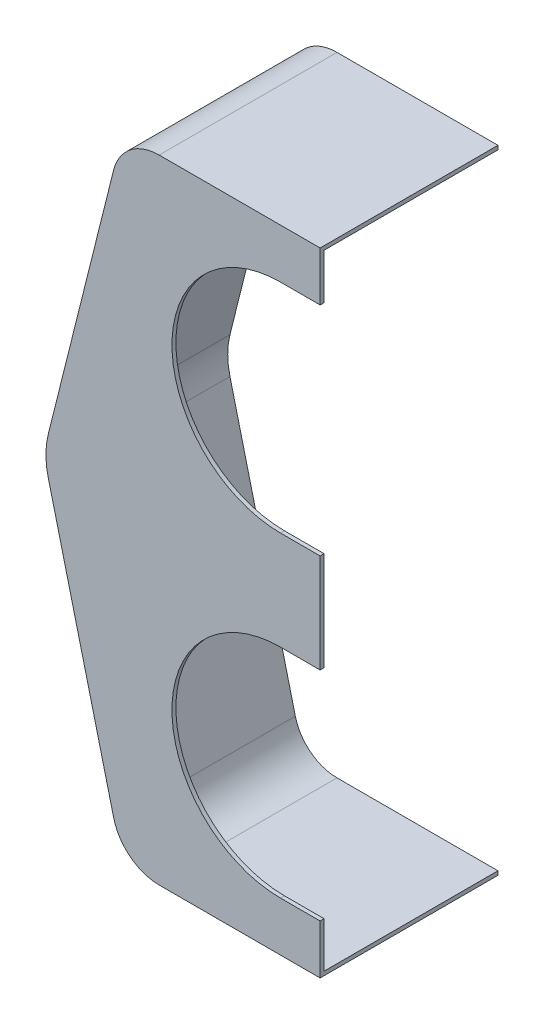
ISO-10303-21;
HEADER;
FILE_DESCRIPTION(('STEP AP214'),'2;1');
FILE_NAME('part.step','',(''),(''),'','','');
FILE_SCHEMA(('AUTOMOTIVE_DESIGN { 1 0 10303 214 1 1 1 1 }'));
ENDSEC;
DATA;
#1=APPLICATION_CONTEXT('core data for automotive mechanical design processes');
#2=APPLICATION_PROTOCOL_DEFINITION('international standard','automotive_design',2000,#1);
#3=PRODUCT_CONTEXT('',#1,'mechanical');
#4=PRODUCT('Part','Part','',(#3));
#5=PRODUCT_RELATED_PRODUCT_CATEGORY('part','',(#4));
#6=PRODUCT_DEFINITION_FORMATION('','',#4);
#7=PRODUCT_DEFINITION_CONTEXT('part definition',#1,'design');
#8=PRODUCT_DEFINITION('design','',#6,#7);
#9=PRODUCT_DEFINITION_SHAPE('','',#8);
#10=(LENGTH_UNIT() NAMED_UNIT(*) SI_UNIT(.MILLI.,.METRE.));
#11=(NAMED_UNIT(*) PLANE_ANGLE_UNIT() SI_UNIT($,.RADIAN.));
#12=(NAMED_UNIT(*) SI_UNIT($,.STERADIAN.) SOLID_ANGLE_UNIT());
#13=UNCERTAINTY_MEASURE_WITH_UNIT(LENGTH_MEASURE(1.E-05),#10,'distance_accuracy_value','');
#14=(GEOMETRIC_REPRESENTATION_CONTEXT(3) GLOBAL_UNCERTAINTY_ASSIGNED_CONTEXT((#13)) GLOBAL_UNIT_ASSIGNED_CONTEXT((#10,
#11,#12)) REPRESENTATION_CONTEXT('',''));
#15=CARTESIAN_POINT('',(0.,0.,0.));
#16=DIRECTION('',(0.,0.,1.));
#17=DIRECTION('',(1.,0.,0.));
#18=AXIS2_PLACEMENT_3D('',#15,#16,#17);
#19=CARTESIAN_POINT('',(0.,0.,0.));
#20=DIRECTION('',(1.,0.,0.));
#21=DIRECTION('',(0.,0.,-1.));
#22=AXIS2_PLACEMENT_3D('',#19,#20,#21);
#23=PLANE('',#22);
#24=DIRECTION('',(0.,-1.,0.));
#25=VECTOR('',#24,1.);
#26=CARTESIAN_POINT('',(0.,0.,-1.27));
#27=LINE('',#26,#25);
#28=CARTESIAN_POINT('',(0.,-85.725,-1.27000000000001));
#29=VERTEX_POINT('',#28);
#30=CARTESIAN_POINT('',(0.,-117.475,-1.27000000000001));
#31=VERTEX_POINT('',#30);
#32=EDGE_CURVE('E339',#29,#31,#27,.T.);
#33=ORIENTED_EDGE('',*,*,#32,.F.);
#34=DIRECTION('',(0.,0.,1.));
#35=VECTOR('',#34,1.);
#36=CARTESIAN_POINT('',(0.,-85.725,-114.3));
#37=LINE('',#36,#35);
#38=CARTESIAN_POINT('',(0.,-85.725,0.));
#39=VERTEX_POINT('',#38);
#40=EDGE_CURVE('E365',#29,#39,#37,.T.);
#41=ORIENTED_EDGE('',*,*,#40,.T.);
#42=DIRECTION('',(0.,-1.,0.));
#43=VECTOR('',#42,1.);
#44=CARTESIAN_POINT('',(0.,0.,0.));
#45=LINE('',#44,#43);
#46=CARTESIAN_POINT('',(0.,-117.475,0.));
#47=VERTEX_POINT('',#46);
#48=EDGE_CURVE('E229',#39,#47,#45,.T.);
#49=ORIENTED_EDGE('',*,*,#48,.T.);
#50=DIRECTION('',(0.,0.,1.));
#51=VECTOR('',#50,1.);
#52=CARTESIAN_POINT('',(0.,-117.475,-114.3));
#53=LINE('',#52,#51);
#54=EDGE_CURVE('E377',#31,#47,#53,.T.);
#55=ORIENTED_EDGE('',*,*,#54,.F.);
#56=EDGE_LOOP('',(#33,#41,#49,#55));
#57=FACE_BOUND('',#56,.T.);
#58=ADVANCED_FACE('F38',(#57),#23,.T.);
#59=CARTESIAN_POINT('',(-12.7,-152.4,-114.3));
#60=DIRECTION('',(0.,0.,1.));
#61=DIRECTION('',(1.,0.,0.));
#62=AXIS2_PLACEMENT_3D('',#59,#60,#61);
#63=CYLINDRICAL_SURFACE('',#62,34.925);
#64=CARTESIAN_POINT('',(-12.7,-152.4,-1.27000000000002));
#65=DIRECTION('',(0.,0.,1.));
#66=DIRECTION('',(0.,-1.,0.));
#67=AXIS2_PLACEMENT_3D('',#64,#65,#66);
#68=CIRCLE('',#67,34.925);
#69=CARTESIAN_POINT('',(-12.7,-117.475,-1.27000000000001));
#70=VERTEX_POINT('',#69);
#71=CARTESIAN_POINT('',(-12.7,-187.325,-1.27000000000002));
#72=VERTEX_POINT('',#71);
#73=EDGE_CURVE('E335',#70,#72,#68,.T.);
#74=ORIENTED_EDGE('',*,*,#73,.F.);
#75=DIRECTION('',(0.,0.,1.));
#76=VECTOR('',#75,1.);
#77=CARTESIAN_POINT('',(-12.7,-117.475,-114.3));
#78=LINE('',#77,#76);
#79=CARTESIAN_POINT('',(-12.7,-117.475,0.));
#80=VERTEX_POINT('',#79);
#81=EDGE_CURVE('E271',#70,#80,#78,.T.);
#82=ORIENTED_EDGE('',*,*,#81,.T.);
#83=CARTESIAN_POINT('',(-12.7,-152.4,0.));
#84=DIRECTION('',(0.,0.,1.));
#85=DIRECTION('',(1.,0.,0.));
#86=AXIS2_PLACEMENT_3D('',#83,#84,#85);
#87=CIRCLE('',#86,34.925);
#88=CARTESIAN_POINT('',(-12.7,-187.325,0.));
#89=VERTEX_POINT('',#88);
#90=EDGE_CURVE('E362',#80,#89,#87,.T.);
#91=ORIENTED_EDGE('',*,*,#90,.T.);
#92=DIRECTION('',(0.,0.,1.));
#93=VECTOR('',#92,1.);
#94=CARTESIAN_POINT('',(-12.7,-187.325,-114.3));
#95=LINE('',#94,#93);
#96=EDGE_CURVE('E375',#72,#89,#95,.T.);
#97=ORIENTED_EDGE('',*,*,#96,.F.);
#98=EDGE_LOOP('',(#74,#82,#91,#97));
#99=FACE_BOUND('',#98,.T.);
#100=ADVANCED_FACE('F401',(#99),#63,.F.);
#101=CARTESIAN_POINT('',(-12.7,-117.475,-114.3));
#102=DIRECTION('',(0.,1.,0.));
#103=DIRECTION('',(0.,0.,1.));
#104=AXIS2_PLACEMENT_3D('',#101,#102,#103);
#105=PLANE('',#104);
#106=DIRECTION('',(-1.,0.,0.));
#107=VECTOR('',#106,1.);
#108=CARTESIAN_POINT('',(-88.9,-117.475,-1.27000000000002));
#109=LINE('',#108,#107);
#110=EDGE_CURVE('E316',#31,#70,#109,.T.);
#111=ORIENTED_EDGE('',*,*,#110,.F.);
#112=ORIENTED_EDGE('',*,*,#54,.T.);
#113=DIRECTION('',(-1.,0.,0.));
#114=VECTOR('',#113,1.);
#115=CARTESIAN_POINT('',(-12.7,-117.475,0.));
#116=LINE('',#115,#114);
#117=EDGE_CURVE('E372',#47,#80,#116,.T.);
#118=ORIENTED_EDGE('',*,*,#117,.T.);
#119=ORIENTED_EDGE('',*,*,#81,.F.);
#120=EDGE_LOOP('',(#111,#112,#118,#119));
#121=FACE_BOUND('',#120,.T.);
#122=ADVANCED_FACE('F394',(#121),#105,.F.);
#123=CARTESIAN_POINT('',(-12.7,-187.325,-114.3));
#124=DIRECTION('',(0.,-1.,0.));
#125=DIRECTION('',(0.,0.,-1.));
#126=AXIS2_PLACEMENT_3D('',#123,#124,#125);
#127=PLANE('',#126);
#128=DIRECTION('',(1.,0.,0.));
#129=VECTOR('',#128,1.);
#130=CARTESIAN_POINT('',(-88.9,-187.325,-1.27000000000003));
#131=LINE('',#130,#129);
#132=CARTESIAN_POINT('',(0.,-187.325,-1.27000000000002));
#133=VERTEX_POINT('',#132);
#134=EDGE_CURVE('E343',#72,#133,#131,.T.);
#135=ORIENTED_EDGE('',*,*,#134,.F.);
#136=ORIENTED_EDGE('',*,*,#96,.T.);
#137=DIRECTION('',(1.,0.,0.));
#138=VECTOR('',#137,1.);
#139=CARTESIAN_POINT('',(-12.7,-187.325,0.));
#140=LINE('',#139,#138);
#141=CARTESIAN_POINT('',(0.,-187.325,0.));
#142=VERTEX_POINT('',#141);
#143=EDGE_CURVE('E370',#89,#142,#140,.T.);
#144=ORIENTED_EDGE('',*,*,#143,.T.);
#145=DIRECTION('',(0.,0.,1.));
#146=VECTOR('',#145,1.);
#147=CARTESIAN_POINT('',(0.,-187.325,-114.3));
#148=LINE('',#147,#146);
#149=EDGE_CURVE('E60',#133,#142,#148,.T.);
#150=ORIENTED_EDGE('',*,*,#149,.F.);
#151=EDGE_LOOP('',(#135,#136,#144,#150));
#152=FACE_BOUND('',#151,.T.);
#153=ADVANCED_FACE('F403',(#152),#127,.F.);
#154=CARTESIAN_POINT('',(-12.7,-50.8,-114.3));
#155=DIRECTION('',(0.,0.,1.));
#156=DIRECTION('',(1.,0.,0.));
#157=AXIS2_PLACEMENT_3D('',#154,#155,#156);
#158=CYLINDRICAL_SURFACE('',#157,34.925);
#159=CARTESIAN_POINT('',(-12.7,-50.8,-1.27000000000001));
#160=DIRECTION('',(0.,0.,1.));
#161=DIRECTION('',(0.,-1.,0.));
#162=AXIS2_PLACEMENT_3D('',#159,#160,#161);
#163=CIRCLE('',#162,34.925);
#164=CARTESIAN_POINT('',(-12.7,-15.875,-1.26999999999999));
#165=VERTEX_POINT('',#164);
#166=CARTESIAN_POINT('',(-12.7,-85.725,-1.27000000000001));
#167=VERTEX_POINT('',#166);
#168=EDGE_CURVE('E293',#165,#167,#163,.T.);
#169=ORIENTED_EDGE('',*,*,#168,.F.);
#170=DIRECTION('',(0.,0.,1.));
#171=VECTOR('',#170,1.);
#172=CARTESIAN_POINT('',(-12.7,-15.875,-114.3));
#173=LINE('',#172,#171);
#174=CARTESIAN_POINT('',(-12.7,-15.875,0.));
#175=VERTEX_POINT('',#174);
#176=EDGE_CURVE('E360',#165,#175,#173,.T.);
#177=ORIENTED_EDGE('',*,*,#176,.T.);
#178=CARTESIAN_POINT('',(-12.7,-50.8,0.));
#179=DIRECTION('',(0.,0.,1.));
#180=DIRECTION('',(1.,0.,0.));
#181=AXIS2_PLACEMENT_3D('',#178,#179,#180);
#182=CIRCLE('',#181,34.925);
#183=CARTESIAN_POINT('',(-12.7,-85.725,0.));
#184=VERTEX_POINT('',#183);
#185=EDGE_CURVE('E327',#175,#184,#182,.T.);
#186=ORIENTED_EDGE('',*,*,#185,.T.);
#187=DIRECTION('',(0.,0.,1.));
#188=VECTOR('',#187,1.);
#189=CARTESIAN_POINT('',(-12.7,-85.725,-114.3));
#190=LINE('',#189,#188);
#191=EDGE_CURVE('E359',#167,#184,#190,.T.);
#192=ORIENTED_EDGE('',*,*,#191,.F.);
#193=EDGE_LOOP('',(#169,#177,#186,#192));
#194=FACE_BOUND('',#193,.T.);
#195=ADVANCED_FACE('F452',(#194),#158,.F.);
#196=CARTESIAN_POINT('',(-12.7,-15.875,-114.3));
#197=DIRECTION('',(0.,1.,0.));
#198=DIRECTION('',(0.,0.,1.));
#199=AXIS2_PLACEMENT_3D('',#196,#197,#198);
#200=PLANE('',#199);
#201=DIRECTION('',(-1.,0.,0.));
#202=VECTOR('',#201,1.);
#203=CARTESIAN_POINT('',(-88.9,-15.875,-1.27));
#204=LINE('',#203,#202);
#205=CARTESIAN_POINT('',(0.,-15.875,-1.26999999999999));
#206=VERTEX_POINT('',#205);
#207=EDGE_CURVE('E333',#206,#165,#204,.T.);
#208=ORIENTED_EDGE('',*,*,#207,.F.);
#209=DIRECTION('',(0.,0.,1.));
#210=VECTOR('',#209,1.);
#211=CARTESIAN_POINT('',(0.,-15.875,-114.3));
#212=LINE('',#211,#210);
#213=CARTESIAN_POINT('',(0.,-15.875,0.));
#214=VERTEX_POINT('',#213);
#215=EDGE_CURVE('E363',#206,#214,#212,.T.);
#216=ORIENTED_EDGE('',*,*,#215,.T.);
#217=DIRECTION('',(-1.,0.,0.));
#218=VECTOR('',#217,1.);
#219=CARTESIAN_POINT('',(-12.7,-15.875,0.));
#220=LINE('',#219,#218);
#221=EDGE_CURVE('E356',#214,#175,#220,.T.);
#222=ORIENTED_EDGE('',*,*,#221,.T.);
#223=ORIENTED_EDGE('',*,*,#176,.F.);
#224=EDGE_LOOP('',(#208,#216,#222,#223));
#225=FACE_BOUND('',#224,.T.);
#226=ADVANCED_FACE('F445',(#225),#200,.F.);
#227=CARTESIAN_POINT('',(-12.7,-85.725,-114.3));
#228=DIRECTION('',(0.,-1.,0.));
#229=DIRECTION('',(0.,0.,-1.));
#230=AXIS2_PLACEMENT_3D('',#227,#228,#229);
#231=PLANE('',#230);
#232=DIRECTION('',(1.,0.,0.));
#233=VECTOR('',#232,1.);
#234=CARTESIAN_POINT('',(-88.9,-85.725,-1.27000000000001));
#235=LINE('',#234,#233);
#236=EDGE_CURVE('E336',#167,#29,#235,.T.);
#237=ORIENTED_EDGE('',*,*,#236,.F.);
#238=ORIENTED_EDGE('',*,*,#191,.T.);
#239=DIRECTION('',(1.,0.,0.));
#240=VECTOR('',#239,1.);
#241=CARTESIAN_POINT('',(-12.7,-85.725,0.));
#242=LINE('',#241,#240);
#243=EDGE_CURVE('E353',#184,#39,#242,.T.);
#244=ORIENTED_EDGE('',*,*,#243,.T.);
#245=ORIENTED_EDGE('',*,*,#40,.F.);
#246=EDGE_LOOP('',(#237,#238,#244,#245));
#247=FACE_BOUND('',#246,.T.);
#248=ADVANCED_FACE('F455',(#247),#231,.F.);
#249=DIRECTION('',(0.,1.,0.));
#250=VECTOR('',#249,1.);
#251=CARTESIAN_POINT('',(0.,-203.2,-57.15));
#252=LINE('',#251,#250);
#253=CARTESIAN_POINT('',(0.,-1.26999999999999,-57.15));
#254=VERTEX_POINT('',#253);
#255=CARTESIAN_POINT('',(0.,0.,-57.15));
#256=VERTEX_POINT('',#255);
#257=EDGE_CURVE('E207',#254,#256,#252,.T.);
#258=ORIENTED_EDGE('',*,*,#257,.T.);
#259=DIRECTION('',(0.,0.,1.));
#260=VECTOR('',#259,1.);
#261=CARTESIAN_POINT('',(0.,0.,0.));
#262=LINE('',#261,#260);
#263=CARTESIAN_POINT('',(0.,0.,0.));
#264=VERTEX_POINT('',#263);
#265=EDGE_CURVE('E223',#256,#264,#262,.T.);
#266=ORIENTED_EDGE('',*,*,#265,.T.);
#267=EDGE_CURVE('E224',#264,#214,#45,.T.);
#268=ORIENTED_EDGE('',*,*,#267,.T.);
#269=ORIENTED_EDGE('',*,*,#215,.F.);
#270=DIRECTION('',(0.,-1.,0.));
#271=VECTOR('',#270,1.);
#272=CARTESIAN_POINT('',(0.,0.,-1.27));
#273=LINE('',#272,#271);
#274=CARTESIAN_POINT('',(0.,-1.27,-1.27));
#275=VERTEX_POINT('',#274);
#276=EDGE_CURVE('E341',#275,#206,#273,.T.);
#277=ORIENTED_EDGE('',*,*,#276,.F.);
#278=DIRECTION('',(0.,0.,1.));
#279=VECTOR('',#278,1.);
#280=CARTESIAN_POINT('',(0.,-1.27,0.));
#281=LINE('',#280,#279);
#282=EDGE_CURVE('E321',#254,#275,#281,.T.);
#283=ORIENTED_EDGE('',*,*,#282,.F.);
#284=EDGE_LOOP('',(#258,#266,#268,#269,#277,#283));
#285=FACE_BOUND('',#284,.T.);
#286=ADVANCED_FACE('F442',(#285),#23,.T.);
#287=CARTESIAN_POINT('',(-88.9,0.,0.));
#288=DIRECTION('',(0.,0.,1.));
#289=DIRECTION('',(0.,-1.,0.));
#290=AXIS2_PLACEMENT_3D('',#287,#288,#289);
#291=PLANE('',#290);
#292=ORIENTED_EDGE('',*,*,#221,.F.);
#293=ORIENTED_EDGE('',*,*,#267,.F.);
#294=DIRECTION('',(1.,0.,0.));
#295=VECTOR('',#294,1.);
#296=CARTESIAN_POINT('',(-88.9,0.,0.));
#297=LINE('',#296,#295);
#298=CARTESIAN_POINT('',(-51.7258917914214,0.,0.));
#299=VERTEX_POINT('',#298);
#300=EDGE_CURVE('E233',#299,#264,#297,.T.);
#301=ORIENTED_EDGE('',*,*,#300,.F.);
#302=CARTESIAN_POINT('',(-51.7258917914214,-15.08,0.));
#303=DIRECTION('',(0.,0.,1.));
#304=DIRECTION('',(0.,-1.,0.));
#305=AXIS2_PLACEMENT_3D('',#302,#303,#304);
#306=CIRCLE('',#305,15.08);
#307=CARTESIAN_POINT('',(-66.355640693613,-11.4225627744521,0.));
#308=VERTEX_POINT('',#307);
#309=EDGE_CURVE('E251',#299,#308,#306,.T.);
#310=ORIENTED_EDGE('',*,*,#309,.T.);
#311=DIRECTION('',(-0.242535625036333,-0.970142500145332,0.));
#312=VECTOR('',#311,1.);
#313=CARTESIAN_POINT('',(-59.7647058823529,14.9411764705882,0.));
#314=LINE('',#313,#312);
#315=CARTESIAN_POINT('',(-87.3696002060207,-95.4784008240831,0.));
#316=VERTEX_POINT('',#315);
#317=EDGE_CURVE('E270',#308,#316,#314,.T.);
#318=ORIENTED_EDGE('',*,*,#317,.T.);
#319=CARTESIAN_POINT('',(-62.8832035023526,-101.6,0.));
#320=DIRECTION('',(0.,0.,1.));
#321=DIRECTION('',(0.,-1.,0.));
#322=AXIS2_PLACEMENT_3D('',#319,#320,#321);
#323=CIRCLE('',#322,25.24);
#324=CARTESIAN_POINT('',(-87.3696002060207,-107.721599175917,0.));
#325=VERTEX_POINT('',#324);
#326=EDGE_CURVE('E242',#316,#325,#323,.T.);
#327=ORIENTED_EDGE('',*,*,#326,.T.);
#328=DIRECTION('',(0.242535625036333,-0.970142500145332,0.));
#329=VECTOR('',#328,1.);
#330=CARTESIAN_POINT('',(-107.576470588235,-26.8941176470588,0.));
#331=LINE('',#330,#329);
#332=CARTESIAN_POINT('',(-66.355640693613,-191.777437225548,0.));
#333=VERTEX_POINT('',#332);
#334=EDGE_CURVE('E259',#325,#333,#331,.T.);
#335=ORIENTED_EDGE('',*,*,#334,.T.);
#336=CARTESIAN_POINT('',(-51.7258917914214,-188.12,0.));
#337=DIRECTION('',(0.,0.,1.));
#338=DIRECTION('',(0.,-1.,0.));
#339=AXIS2_PLACEMENT_3D('',#336,#337,#338);
#340=CIRCLE('',#339,15.08);
#341=CARTESIAN_POINT('',(-51.7258917914214,-203.2,0.));
#342=VERTEX_POINT('',#341);
#343=EDGE_CURVE('E249',#333,#342,#340,.T.);
#344=ORIENTED_EDGE('',*,*,#343,.T.);
#345=DIRECTION('',(1.,0.,0.));
#346=VECTOR('',#345,1.);
#347=CARTESIAN_POINT('',(-88.9,-203.2,0.));
#348=LINE('',#347,#346);
#349=CARTESIAN_POINT('',(0.,-203.2,0.));
#350=VERTEX_POINT('',#349);
#351=EDGE_CURVE('E226',#342,#350,#348,.T.);
#352=ORIENTED_EDGE('',*,*,#351,.T.);
#353=EDGE_CURVE('E221',#142,#350,#45,.T.);
#354=ORIENTED_EDGE('',*,*,#353,.F.);
#355=ORIENTED_EDGE('',*,*,#143,.F.);
#356=ORIENTED_EDGE('',*,*,#90,.F.);
#357=ORIENTED_EDGE('',*,*,#117,.F.);
#358=ORIENTED_EDGE('',*,*,#48,.F.);
#359=ORIENTED_EDGE('',*,*,#243,.F.);
#360=ORIENTED_EDGE('',*,*,#185,.F.);
#361=EDGE_LOOP('',(#292,#293,#301,#310,#318,#327,#335,#344,#352,#354,#355,#356,#357,#358,#359,#360));
#362=FACE_BOUND('',#361,.T.);
#363=ADVANCED_FACE('F267',(#362),#291,.T.);
#364=CARTESIAN_POINT('',(-88.9,0.,0.));
#365=DIRECTION('',(0.,1.,0.));
#366=DIRECTION('',(0.,0.,1.));
#367=AXIS2_PLACEMENT_3D('',#364,#365,#366);
#368=PLANE('',#367);
#369=DIRECTION('',(1.,0.,0.));
#370=VECTOR('',#369,1.);
#371=CARTESIAN_POINT('',(-88.1232035023526,0.,-57.15));
#372=LINE('',#371,#370);
#373=CARTESIAN_POINT('',(-51.7258917914214,0.,-57.15));
#374=VERTEX_POINT('',#373);
#375=EDGE_CURVE('E217',#374,#256,#372,.T.);
#376=ORIENTED_EDGE('',*,*,#375,.F.);
#377=DIRECTION('',(0.,0.,-1.));
#378=VECTOR('',#377,1.);
#379=CARTESIAN_POINT('',(-51.7258917914214,0.,0.));
#380=LINE('',#379,#378);
#381=EDGE_CURVE('E247',#374,#299,#380,.F.);
#382=ORIENTED_EDGE('',*,*,#381,.T.);
#383=ORIENTED_EDGE('',*,*,#300,.T.);
#384=ORIENTED_EDGE('',*,*,#265,.F.);
#385=EDGE_LOOP('',(#376,#382,#383,#384));
#386=FACE_BOUND('',#385,.T.);
#387=ADVANCED_FACE('F480',(#386),#368,.T.);
#388=CARTESIAN_POINT('',(-88.9,-203.2,0.));
#389=DIRECTION('',(0.,-1.,0.));
#390=DIRECTION('',(0.,0.,-1.));
#391=AXIS2_PLACEMENT_3D('',#388,#389,#390);
#392=PLANE('',#391);
#393=DIRECTION('',(1.,0.,0.));
#394=VECTOR('',#393,1.);
#395=CARTESIAN_POINT('',(-88.1232035023526,-203.2,-57.15));
#396=LINE('',#395,#394);
#397=CARTESIAN_POINT('',(-51.7258917914214,-203.2,-57.15));
#398=VERTEX_POINT('',#397);
#399=CARTESIAN_POINT('',(0.,-203.2,-57.15));
#400=VERTEX_POINT('',#399);
#401=EDGE_CURVE('E200',#398,#400,#396,.T.);
#402=ORIENTED_EDGE('',*,*,#401,.T.);
#403=DIRECTION('',(0.,0.,-1.));
#404=VECTOR('',#403,1.);
#405=CARTESIAN_POINT('',(0.,-203.2,0.));
#406=LINE('',#405,#404);
#407=EDGE_CURVE('E214',#350,#400,#406,.T.);
#408=ORIENTED_EDGE('',*,*,#407,.F.);
#409=ORIENTED_EDGE('',*,*,#351,.F.);
#410=DIRECTION('',(0.,0.,-1.));
#411=VECTOR('',#410,1.);
#412=CARTESIAN_POINT('',(-51.7258917914214,-203.2,-114.3));
#413=LINE('',#412,#411);
#414=EDGE_CURVE('E216',#342,#398,#413,.T.);
#415=ORIENTED_EDGE('',*,*,#414,.T.);
#416=EDGE_LOOP('',(#402,#408,#409,#415));
#417=FACE_BOUND('',#416,.T.);
#418=ADVANCED_FACE('F212',(#417),#392,.T.);
#419=CARTESIAN_POINT('',(0.,-201.93,-57.15));
#420=VERTEX_POINT('',#419);
#421=EDGE_CURVE('E197',#400,#420,#252,.T.);
#422=ORIENTED_EDGE('',*,*,#421,.T.);
#423=DIRECTION('',(0.,0.,-1.));
#424=VECTOR('',#423,1.);
#425=CARTESIAN_POINT('',(0.,-201.93,0.));
#426=LINE('',#425,#424);
#427=CARTESIAN_POINT('',(0.,-201.93,-1.27000000000003));
#428=VERTEX_POINT('',#427);
#429=EDGE_CURVE('E347',#428,#420,#426,.T.);
#430=ORIENTED_EDGE('',*,*,#429,.F.);
#431=DIRECTION('',(0.,-1.,0.));
#432=VECTOR('',#431,1.);
#433=CARTESIAN_POINT('',(0.,0.,-1.27));
#434=LINE('',#433,#432);
#435=EDGE_CURVE('E308',#133,#428,#434,.T.);
#436=ORIENTED_EDGE('',*,*,#435,.F.);
#437=ORIENTED_EDGE('',*,*,#149,.T.);
#438=ORIENTED_EDGE('',*,*,#353,.T.);
#439=ORIENTED_EDGE('',*,*,#407,.T.);
#440=EDGE_LOOP('',(#422,#430,#436,#437,#438,#439));
#441=FACE_BOUND('',#440,.T.);
#442=ADVANCED_FACE('F219',(#441),#23,.T.);
#443=CARTESIAN_POINT('',(-59.7647058823529,14.9411764705882,0.));
#444=DIRECTION('',(0.970142500145332,-0.242535625036333,0.));
#445=DIRECTION('',(0.242535625036333,0.970142500145332,0.));
#446=AXIS2_PLACEMENT_3D('',#443,#444,#445);
#447=PLANE('',#446);
#448=DIRECTION('',(0.,0.,-1.));
#449=VECTOR('',#448,1.);
#450=CARTESIAN_POINT('',(-66.355640693613,-11.4225627744521,-114.3));
#451=LINE('',#450,#449);
#452=CARTESIAN_POINT('',(-66.355640693613,-11.4225627744521,-57.15));
#453=VERTEX_POINT('',#452);
#454=EDGE_CURVE('E244',#308,#453,#451,.T.);
#455=ORIENTED_EDGE('',*,*,#454,.T.);
#456=DIRECTION('',(-0.242535625036333,-0.970142500145332,0.));
#457=VECTOR('',#456,1.);
#458=CARTESIAN_POINT('',(-59.7647058823529,14.9411764705882,-57.15));
#459=LINE('',#458,#457);
#460=CARTESIAN_POINT('',(-87.3696002060207,-95.478400824083,-57.15));
#461=VERTEX_POINT('',#460);
#462=EDGE_CURVE('E284',#453,#461,#459,.T.);
#463=ORIENTED_EDGE('',*,*,#462,.T.);
#464=DIRECTION('',(0.,0.,-1.));
#465=VECTOR('',#464,1.);
#466=CARTESIAN_POINT('',(-87.3696002060207,-95.478400824083,0.));
#467=LINE('',#466,#465);
#468=EDGE_CURVE('E240',#461,#316,#467,.F.);
#469=ORIENTED_EDGE('',*,*,#468,.T.);
#470=ORIENTED_EDGE('',*,*,#317,.F.);
#471=EDGE_LOOP('',(#455,#463,#469,#470));
#472=FACE_BOUND('',#471,.T.);
#473=ADVANCED_FACE('F474',(#472),#447,.F.);
#474=CARTESIAN_POINT('',(-107.576470588235,-26.8941176470588,0.));
#475=DIRECTION('',(0.970142500145332,0.242535625036333,0.));
#476=DIRECTION('',(-0.242535625036333,0.970142500145332,0.));
#477=AXIS2_PLACEMENT_3D('',#474,#475,#476);
#478=PLANE('',#477);
#479=DIRECTION('',(0.,0.,-1.));
#480=VECTOR('',#479,1.);
#481=CARTESIAN_POINT('',(-87.3696002060207,-107.721599175917,0.));
#482=LINE('',#481,#480);
#483=CARTESIAN_POINT('',(-87.3696002060207,-107.721599175917,-57.15));
#484=VERTEX_POINT('',#483);
#485=EDGE_CURVE('E236',#325,#484,#482,.T.);
#486=ORIENTED_EDGE('',*,*,#485,.T.);
#487=DIRECTION('',(0.242535625036333,-0.970142500145332,0.));
#488=VECTOR('',#487,1.);
#489=CARTESIAN_POINT('',(-107.576470588235,-26.8941176470588,-57.15));
#490=LINE('',#489,#488);
#491=CARTESIAN_POINT('',(-66.355640693613,-191.777437225548,-57.15));
#492=VERTEX_POINT('',#491);
#493=EDGE_CURVE('E262',#484,#492,#490,.T.);
#494=ORIENTED_EDGE('',*,*,#493,.T.);
#495=DIRECTION('',(0.,0.,-1.));
#496=VECTOR('',#495,1.);
#497=CARTESIAN_POINT('',(-66.355640693613,-191.777437225548,0.));
#498=LINE('',#497,#496);
#499=EDGE_CURVE('E46',#492,#333,#498,.F.);
#500=ORIENTED_EDGE('',*,*,#499,.T.);
#501=ORIENTED_EDGE('',*,*,#334,.F.);
#502=EDGE_LOOP('',(#486,#494,#500,#501));
#503=FACE_BOUND('',#502,.T.);
#504=ADVANCED_FACE('F258',(#503),#478,.F.);
#505=CARTESIAN_POINT('',(-62.8832035023526,-101.6,0.));
#506=DIRECTION('',(0.,0.,-1.));
#507=DIRECTION('',(0.,1.,0.));
#508=AXIS2_PLACEMENT_3D('',#505,#506,#507);
#509=CYLINDRICAL_SURFACE('',#508,25.24);
#510=CARTESIAN_POINT('',(-62.8832035023526,-101.6,-57.15));
#511=DIRECTION('',(0.,0.,1.));
#512=DIRECTION('',(1.,0.,0.));
#513=AXIS2_PLACEMENT_3D('',#510,#511,#512);
#514=CIRCLE('',#513,25.24);
#515=EDGE_CURVE('E276',#484,#461,#514,.F.);
#516=ORIENTED_EDGE('',*,*,#515,.F.);
#517=ORIENTED_EDGE('',*,*,#485,.F.);
#518=ORIENTED_EDGE('',*,*,#326,.F.);
#519=ORIENTED_EDGE('',*,*,#468,.F.);
#520=EDGE_LOOP('',(#516,#517,#518,#519));
#521=FACE_BOUND('',#520,.T.);
#522=ADVANCED_FACE('F489',(#521),#509,.T.);
#523=CARTESIAN_POINT('',(-51.7258917914214,-15.08,0.));
#524=DIRECTION('',(0.,0.,1.));
#525=DIRECTION('',(1.,0.,0.));
#526=AXIS2_PLACEMENT_3D('',#523,#524,#525);
#527=CYLINDRICAL_SURFACE('',#526,15.08);
#528=CARTESIAN_POINT('',(-51.7258917914214,-15.08,-57.15));
#529=DIRECTION('',(0.,0.,1.));
#530=DIRECTION('',(1.,0.,0.));
#531=AXIS2_PLACEMENT_3D('',#528,#529,#530);
#532=CIRCLE('',#531,15.08);
#533=EDGE_CURVE('E287',#453,#374,#532,.F.);
#534=ORIENTED_EDGE('',*,*,#533,.F.);
#535=ORIENTED_EDGE('',*,*,#454,.F.);
#536=ORIENTED_EDGE('',*,*,#309,.F.);
#537=ORIENTED_EDGE('',*,*,#381,.F.);
#538=EDGE_LOOP('',(#534,#535,#536,#537));
#539=FACE_BOUND('',#538,.T.);
#540=ADVANCED_FACE('F491',(#539),#527,.T.);
#541=CARTESIAN_POINT('',(-51.7258917914214,-188.12,0.));
#542=DIRECTION('',(0.,0.,1.));
#543=DIRECTION('',(1.,0.,0.));
#544=AXIS2_PLACEMENT_3D('',#541,#542,#543);
#545=CYLINDRICAL_SURFACE('',#544,15.08);
#546=CARTESIAN_POINT('',(-51.7258917914214,-188.12,-57.15));
#547=DIRECTION('',(0.,0.,1.));
#548=DIRECTION('',(1.,0.,0.));
#549=AXIS2_PLACEMENT_3D('',#546,#547,#548);
#550=CIRCLE('',#549,15.08);
#551=EDGE_CURVE('E273',#398,#492,#550,.F.);
#552=ORIENTED_EDGE('',*,*,#551,.F.);
#553=ORIENTED_EDGE('',*,*,#414,.F.);
#554=ORIENTED_EDGE('',*,*,#343,.F.);
#555=ORIENTED_EDGE('',*,*,#499,.F.);
#556=EDGE_LOOP('',(#552,#553,#554,#555));
#557=FACE_BOUND('',#556,.T.);
#558=ADVANCED_FACE('F40',(#557),#545,.T.);
#559=CARTESIAN_POINT('',(-88.9,0.,-1.27));
#560=DIRECTION('',(0.,0.,1.));
#561=DIRECTION('',(0.,-1.,0.));
#562=AXIS2_PLACEMENT_3D('',#559,#560,#561);
#563=PLANE('',#562);
#564=CARTESIAN_POINT('',(-12.7,-101.6,-1.26999999999998));
#565=DIRECTION('',(0.,0.,1.));
#566=DIRECTION('',(1.,0.,0.));
#567=AXIS2_PLACEMENT_3D('',#564,#565,#566);
#568=CIRCLE('',#567,3.);
#569=CARTESIAN_POINT('',(-9.7,-101.6,-1.26999999999998));
#570=VERTEX_POINT('',#569);
#571=EDGE_CURVE('E289',#570,#570,#568,.T.);
#572=ORIENTED_EDGE('',*,*,#571,.T.);
#573=EDGE_LOOP('',(#572));
#574=FACE_BOUND('',#573,.T.);
#575=ORIENTED_EDGE('',*,*,#207,.T.);
#576=ORIENTED_EDGE('',*,*,#168,.T.);
#577=ORIENTED_EDGE('',*,*,#236,.T.);
#578=ORIENTED_EDGE('',*,*,#32,.T.);
#579=ORIENTED_EDGE('',*,*,#110,.T.);
#580=ORIENTED_EDGE('',*,*,#73,.T.);
#581=ORIENTED_EDGE('',*,*,#134,.T.);
#582=ORIENTED_EDGE('',*,*,#435,.T.);
#583=DIRECTION('',(1.,0.,0.));
#584=VECTOR('',#583,1.);
#585=CARTESIAN_POINT('',(-88.9,-201.93,-1.27000000000003));
#586=LINE('',#585,#584);
#587=CARTESIAN_POINT('',(-51.7258917914214,-201.93,-1.27000000000003));
#588=VERTEX_POINT('',#587);
#589=EDGE_CURVE('E300',#588,#428,#586,.T.);
#590=ORIENTED_EDGE('',*,*,#589,.F.);
#591=CARTESIAN_POINT('',(-51.7258917914214,-188.12,-1.27000000000003));
#592=DIRECTION('',(0.,0.,1.));
#593=DIRECTION('',(0.,-1.,0.));
#594=AXIS2_PLACEMENT_3D('',#591,#592,#593);
#595=CIRCLE('',#594,13.81);
#596=CARTESIAN_POINT('',(-65.1235597184285,-191.469416981752,-1.27000000000003));
#597=VERTEX_POINT('',#596);
#598=EDGE_CURVE('E304',#597,#588,#595,.T.);
#599=ORIENTED_EDGE('',*,*,#598,.F.);
#600=DIRECTION('',(0.242535625036333,-0.970142500145332,0.));
#601=VECTOR('',#600,1.);
#602=CARTESIAN_POINT('',(-106.344389613051,-26.5860974032627,-1.27));
#603=LINE('',#602,#601);
#604=CARTESIAN_POINT('',(-86.1375192308362,-107.413578932121,-1.27000000000002));
#605=VERTEX_POINT('',#604);
#606=EDGE_CURVE('E309',#605,#597,#603,.T.);
#607=ORIENTED_EDGE('',*,*,#606,.F.);
#608=CARTESIAN_POINT('',(-62.8832035023526,-101.6,-1.27000000000002));
#609=DIRECTION('',(0.,0.,1.));
#610=DIRECTION('',(0.,-1.,0.));
#611=AXIS2_PLACEMENT_3D('',#608,#609,#610);
#612=CIRCLE('',#611,23.97);
#613=CARTESIAN_POINT('',(-86.1375192308362,-95.7864210678792,-1.27000000000002));
#614=VERTEX_POINT('',#613);
#615=EDGE_CURVE('E310',#614,#605,#612,.T.);
#616=ORIENTED_EDGE('',*,*,#615,.F.);
#617=DIRECTION('',(-0.242535625036333,-0.970142500145332,0.));
#618=VECTOR('',#617,1.);
#619=CARTESIAN_POINT('',(-58.5326249071684,14.6331562267921,-1.27));
#620=LINE('',#619,#618);
#621=CARTESIAN_POINT('',(-65.1235597184285,-11.7305830182482,-1.27));
#622=VERTEX_POINT('',#621);
#623=EDGE_CURVE('E305',#622,#614,#620,.T.);
#624=ORIENTED_EDGE('',*,*,#623,.F.);
#625=CARTESIAN_POINT('',(-51.7258917914214,-15.08,-1.27));
#626=DIRECTION('',(0.,0.,1.));
#627=DIRECTION('',(0.,-1.,0.));
#628=AXIS2_PLACEMENT_3D('',#625,#626,#627);
#629=CIRCLE('',#628,13.81);
#630=CARTESIAN_POINT('',(-51.7258917914214,-1.27,-1.27));
#631=VERTEX_POINT('',#630);
#632=EDGE_CURVE('E301',#631,#622,#629,.T.);
#633=ORIENTED_EDGE('',*,*,#632,.F.);
#634=DIRECTION('',(1.,0.,0.));
#635=VECTOR('',#634,1.);
#636=CARTESIAN_POINT('',(-88.9,-1.27,-1.27));
#637=LINE('',#636,#635);
#638=EDGE_CURVE('E296',#631,#275,#637,.T.);
#639=ORIENTED_EDGE('',*,*,#638,.T.);
#640=ORIENTED_EDGE('',*,*,#276,.T.);
#641=EDGE_LOOP('',(#575,#576,#577,#578,#579,#580,#581,#582,#590,#599,#607,#616,#624,#633,#639,#640));
#642=FACE_BOUND('',#641,.T.);
#643=ADVANCED_FACE('F397',(#574,#642),#563,.F.);
#644=CARTESIAN_POINT('',(-88.9,-1.27,0.));
#645=DIRECTION('',(0.,1.,0.));
#646=DIRECTION('',(0.,0.,1.));
#647=AXIS2_PLACEMENT_3D('',#644,#645,#646);
#648=PLANE('',#647);
#649=DIRECTION('',(0.,0.,1.));
#650=VECTOR('',#649,1.);
#651=CARTESIAN_POINT('',(-51.7258917914214,-1.27,0.));
#652=LINE('',#651,#650);
#653=CARTESIAN_POINT('',(-51.7258917914214,-1.27,-57.15));
#654=VERTEX_POINT('',#653);
#655=EDGE_CURVE('E318',#654,#631,#652,.T.);
#656=ORIENTED_EDGE('',*,*,#655,.F.);
#657=DIRECTION('',(1.,0.,0.));
#658=VECTOR('',#657,1.);
#659=CARTESIAN_POINT('',(-88.9,-1.27,-57.15));
#660=LINE('',#659,#658);
#661=EDGE_CURVE('E274',#654,#254,#660,.T.);
#662=ORIENTED_EDGE('',*,*,#661,.T.);
#663=ORIENTED_EDGE('',*,*,#282,.T.);
#664=ORIENTED_EDGE('',*,*,#638,.F.);
#665=EDGE_LOOP('',(#656,#662,#663,#664));
#666=FACE_BOUND('',#665,.T.);
#667=ADVANCED_FACE('F435',(#666),#648,.F.);
#668=CARTESIAN_POINT('',(-88.9,-201.93,0.));
#669=DIRECTION('',(0.,-1.,0.));
#670=DIRECTION('',(0.,0.,-1.));
#671=AXIS2_PLACEMENT_3D('',#668,#669,#670);
#672=PLANE('',#671);
#673=ORIENTED_EDGE('',*,*,#429,.T.);
#674=DIRECTION('',(-1.,0.,0.));
#675=VECTOR('',#674,1.);
#676=CARTESIAN_POINT('',(-88.9,-201.93,-57.15));
#677=LINE('',#676,#675);
#678=CARTESIAN_POINT('',(-51.7258917914214,-201.93,-57.15));
#679=VERTEX_POINT('',#678);
#680=EDGE_CURVE('E203',#420,#679,#677,.T.);
#681=ORIENTED_EDGE('',*,*,#680,.T.);
#682=DIRECTION('',(0.,0.,-1.));
#683=VECTOR('',#682,1.);
#684=CARTESIAN_POINT('',(-51.7258917914214,-201.93,0.));
#685=LINE('',#684,#683);
#686=EDGE_CURVE('E303',#588,#679,#685,.T.);
#687=ORIENTED_EDGE('',*,*,#686,.F.);
#688=ORIENTED_EDGE('',*,*,#589,.T.);
#689=EDGE_LOOP('',(#673,#681,#687,#688));
#690=FACE_BOUND('',#689,.T.);
#691=ADVANCED_FACE('F406',(#690),#672,.F.);
#692=CARTESIAN_POINT('',(-58.5326249071684,14.6331562267921,0.));
#693=DIRECTION('',(0.970142500145332,-0.242535625036333,0.));
#694=DIRECTION('',(0.242535625036333,0.970142500145332,0.));
#695=AXIS2_PLACEMENT_3D('',#692,#693,#694);
#696=PLANE('',#695);
#697=DIRECTION('',(-0.242535625036333,-0.970142500145332,0.));
#698=VECTOR('',#697,1.);
#699=CARTESIAN_POINT('',(-58.5326249071684,14.6331562267921,-57.15));
#700=LINE('',#699,#698);
#701=CARTESIAN_POINT('',(-65.1235597184285,-11.7305830182482,-57.15));
#702=VERTEX_POINT('',#701);
#703=CARTESIAN_POINT('',(-86.1375192308362,-95.7864210678792,-57.15));
#704=VERTEX_POINT('',#703);
#705=EDGE_CURVE('E428',#702,#704,#700,.T.);
#706=ORIENTED_EDGE('',*,*,#705,.F.);
#707=DIRECTION('',(0.,0.,1.));
#708=VECTOR('',#707,1.);
#709=CARTESIAN_POINT('',(-65.1235597184285,-11.7305830182482,0.));
#710=LINE('',#709,#708);
#711=EDGE_CURVE('E312',#622,#702,#710,.F.);
#712=ORIENTED_EDGE('',*,*,#711,.F.);
#713=ORIENTED_EDGE('',*,*,#623,.T.);
#714=DIRECTION('',(0.,0.,1.));
#715=VECTOR('',#714,1.);
#716=CARTESIAN_POINT('',(-86.1375192308362,-95.7864210678792,0.));
#717=LINE('',#716,#715);
#718=EDGE_CURVE('E313',#704,#614,#717,.T.);
#719=ORIENTED_EDGE('',*,*,#718,.F.);
#720=EDGE_LOOP('',(#706,#712,#713,#719));
#721=FACE_BOUND('',#720,.T.);
#722=ADVANCED_FACE('F427',(#721),#696,.T.);
#723=CARTESIAN_POINT('',(-106.344389613051,-26.5860974032627,0.));
#724=DIRECTION('',(0.970142500145332,0.242535625036333,0.));
#725=DIRECTION('',(-0.242535625036333,0.970142500145332,0.));
#726=AXIS2_PLACEMENT_3D('',#723,#724,#725);
#727=PLANE('',#726);
#728=DIRECTION('',(0.242535625036333,-0.970142500145332,0.));
#729=VECTOR('',#728,1.);
#730=CARTESIAN_POINT('',(-106.344389613051,-26.5860974032627,-57.15));
#731=LINE('',#730,#729);
#732=CARTESIAN_POINT('',(-86.1375192308362,-107.413578932121,-57.15));
#733=VERTEX_POINT('',#732);
#734=CARTESIAN_POINT('',(-65.1235597184285,-191.469416981752,-57.15));
#735=VERTEX_POINT('',#734);
#736=EDGE_CURVE('E53',#733,#735,#731,.T.);
#737=ORIENTED_EDGE('',*,*,#736,.F.);
#738=DIRECTION('',(0.,0.,1.));
#739=VECTOR('',#738,1.);
#740=CARTESIAN_POINT('',(-86.1375192308362,-107.413578932121,0.));
#741=LINE('',#740,#739);
#742=EDGE_CURVE('E299',#605,#733,#741,.F.);
#743=ORIENTED_EDGE('',*,*,#742,.F.);
#744=ORIENTED_EDGE('',*,*,#606,.T.);
#745=DIRECTION('',(0.,0.,1.));
#746=VECTOR('',#745,1.);
#747=CARTESIAN_POINT('',(-65.1235597184285,-191.469416981752,0.));
#748=LINE('',#747,#746);
#749=EDGE_CURVE('E325',#735,#597,#748,.T.);
#750=ORIENTED_EDGE('',*,*,#749,.F.);
#751=EDGE_LOOP('',(#737,#743,#744,#750));
#752=FACE_BOUND('',#751,.T.);
#753=ADVANCED_FACE('F416',(#752),#727,.T.);
#754=CARTESIAN_POINT('',(-62.8832035023526,-101.6,0.));
#755=DIRECTION('',(0.,0.,-1.));
#756=DIRECTION('',(0.,1.,0.));
#757=AXIS2_PLACEMENT_3D('',#754,#755,#756);
#758=CYLINDRICAL_SURFACE('',#757,23.97);
#759=ORIENTED_EDGE('',*,*,#742,.T.);
#760=CARTESIAN_POINT('',(-62.8832035023526,-101.6,-57.15));
#761=DIRECTION('',(0.,0.,1.));
#762=DIRECTION('',(1.,0.,0.));
#763=AXIS2_PLACEMENT_3D('',#760,#761,#762);
#764=CIRCLE('',#763,23.97);
#765=EDGE_CURVE('E420',#733,#704,#764,.F.);
#766=ORIENTED_EDGE('',*,*,#765,.T.);
#767=ORIENTED_EDGE('',*,*,#718,.T.);
#768=ORIENTED_EDGE('',*,*,#615,.T.);
#769=EDGE_LOOP('',(#759,#766,#767,#768));
#770=FACE_BOUND('',#769,.T.);
#771=ADVANCED_FACE('F419',(#770),#758,.F.);
#772=CARTESIAN_POINT('',(-51.7258917914214,-15.08,0.));
#773=DIRECTION('',(0.,0.,1.));
#774=DIRECTION('',(1.,0.,0.));
#775=AXIS2_PLACEMENT_3D('',#772,#773,#774);
#776=CYLINDRICAL_SURFACE('',#775,13.81);
#777=ORIENTED_EDGE('',*,*,#711,.T.);
#778=CARTESIAN_POINT('',(-51.7258917914214,-15.08,-57.15));
#779=DIRECTION('',(0.,0.,1.));
#780=DIRECTION('',(1.,0.,0.));
#781=AXIS2_PLACEMENT_3D('',#778,#779,#780);
#782=CIRCLE('',#781,13.81);
#783=EDGE_CURVE('E279',#702,#654,#782,.F.);
#784=ORIENTED_EDGE('',*,*,#783,.T.);
#785=ORIENTED_EDGE('',*,*,#655,.T.);
#786=ORIENTED_EDGE('',*,*,#632,.T.);
#787=EDGE_LOOP('',(#777,#784,#785,#786));
#788=FACE_BOUND('',#787,.T.);
#789=ADVANCED_FACE('F431',(#788),#776,.F.);
#790=CARTESIAN_POINT('',(-51.7258917914214,-188.12,0.));
#791=DIRECTION('',(0.,0.,1.));
#792=DIRECTION('',(1.,0.,0.));
#793=AXIS2_PLACEMENT_3D('',#790,#791,#792);
#794=CYLINDRICAL_SURFACE('',#793,13.81);
#795=ORIENTED_EDGE('',*,*,#686,.T.);
#796=CARTESIAN_POINT('',(-51.7258917914214,-188.12,-57.15));
#797=DIRECTION('',(0.,0.,1.));
#798=DIRECTION('',(1.,0.,0.));
#799=AXIS2_PLACEMENT_3D('',#796,#797,#798);
#800=CIRCLE('',#799,13.81);
#801=EDGE_CURVE('E12',#679,#735,#800,.F.);
#802=ORIENTED_EDGE('',*,*,#801,.T.);
#803=ORIENTED_EDGE('',*,*,#749,.T.);
#804=ORIENTED_EDGE('',*,*,#598,.T.);
#805=EDGE_LOOP('',(#795,#802,#803,#804));
#806=FACE_BOUND('',#805,.T.);
#807=ADVANCED_FACE('F413',(#806),#794,.F.);
#808=CARTESIAN_POINT('',(-12.7,-101.6,-10.16));
#809=DIRECTION('',(0.,0.,1.));
#810=DIRECTION('',(1.,0.,0.));
#811=AXIS2_PLACEMENT_3D('',#808,#809,#810);
#812=CYLINDRICAL_SURFACE('',#811,3.);
#813=CARTESIAN_POINT('',(-12.7,-101.6,-10.16));
#814=DIRECTION('',(0.,0.,1.));
#815=DIRECTION('',(1.,0.,0.));
#816=AXIS2_PLACEMENT_3D('',#813,#814,#815);
#817=CIRCLE('',#816,3.);
#818=CARTESIAN_POINT('',(-9.7,-101.6,-10.16));
#819=VERTEX_POINT('',#818);
#820=EDGE_CURVE('E290',#819,#819,#817,.T.);
#821=ORIENTED_EDGE('',*,*,#820,.T.);
#822=EDGE_LOOP('',(#821));
#823=FACE_BOUND('',#822,.T.);
#824=ORIENTED_EDGE('',*,*,#571,.F.);
#825=EDGE_LOOP('',(#824));
#826=FACE_BOUND('',#825,.T.);
#827=ADVANCED_FACE('F521',(#823,#826),#812,.T.);
#828=CARTESIAN_POINT('',(-12.7,-101.6,-10.16));
#829=DIRECTION('',(0.,0.,-1.));
#830=DIRECTION('',(1.,0.,0.));
#831=AXIS2_PLACEMENT_3D('',#828,#829,#830);
#832=PLANE('',#831);
#833=ORIENTED_EDGE('',*,*,#820,.F.);
#834=EDGE_LOOP('',(#833));
#835=FACE_BOUND('',#834,.T.);
#836=ADVANCED_FACE('F539',(#835),#832,.T.);
#837=CARTESIAN_POINT('',(-88.1232035023526,-203.2,-57.15));
#838=DIRECTION('',(0.,0.,1.));
#839=DIRECTION('',(1.,0.,0.));
#840=AXIS2_PLACEMENT_3D('',#837,#838,#839);
#841=PLANE('',#840);
#842=ORIENTED_EDGE('',*,*,#533,.T.);
#843=ORIENTED_EDGE('',*,*,#375,.T.);
#844=ORIENTED_EDGE('',*,*,#257,.F.);
#845=ORIENTED_EDGE('',*,*,#661,.F.);
#846=ORIENTED_EDGE('',*,*,#783,.F.);
#847=ORIENTED_EDGE('',*,*,#705,.T.);
#848=ORIENTED_EDGE('',*,*,#765,.F.);
#849=ORIENTED_EDGE('',*,*,#736,.T.);
#850=ORIENTED_EDGE('',*,*,#801,.F.);
#851=ORIENTED_EDGE('',*,*,#680,.F.);
#852=ORIENTED_EDGE('',*,*,#421,.F.);
#853=ORIENTED_EDGE('',*,*,#401,.F.);
#854=ORIENTED_EDGE('',*,*,#551,.T.);
#855=ORIENTED_EDGE('',*,*,#493,.F.);
#856=ORIENTED_EDGE('',*,*,#515,.T.);
#857=ORIENTED_EDGE('',*,*,#462,.F.);
#858=EDGE_LOOP('',(#842,#843,#844,#845,#846,#847,#848,#849,#850,#851,#852,#853,#854,#855,#856,#857));
#859=FACE_BOUND('',#858,.T.);
#860=ADVANCED_FACE('F199',(#859),#841,.F.);
#861=CLOSED_SHELL('',(#58,#100,#122,#153,#195,#226,#248,#286,#363,#387,#418,#442,#473,#504,#522,
#540,#558,#643,#667,#691,#722,#753,#771,#789,#807,#827,#836,#860));
#862=MANIFOLD_SOLID_BREP('B2',#861);
#863=ADVANCED_BREP_SHAPE_REPRESENTATION('',(#18,#862),#14);
#864=SHAPE_DEFINITION_REPRESENTATION(#9,#863);
ENDSEC;
END-ISO-10303-21;
